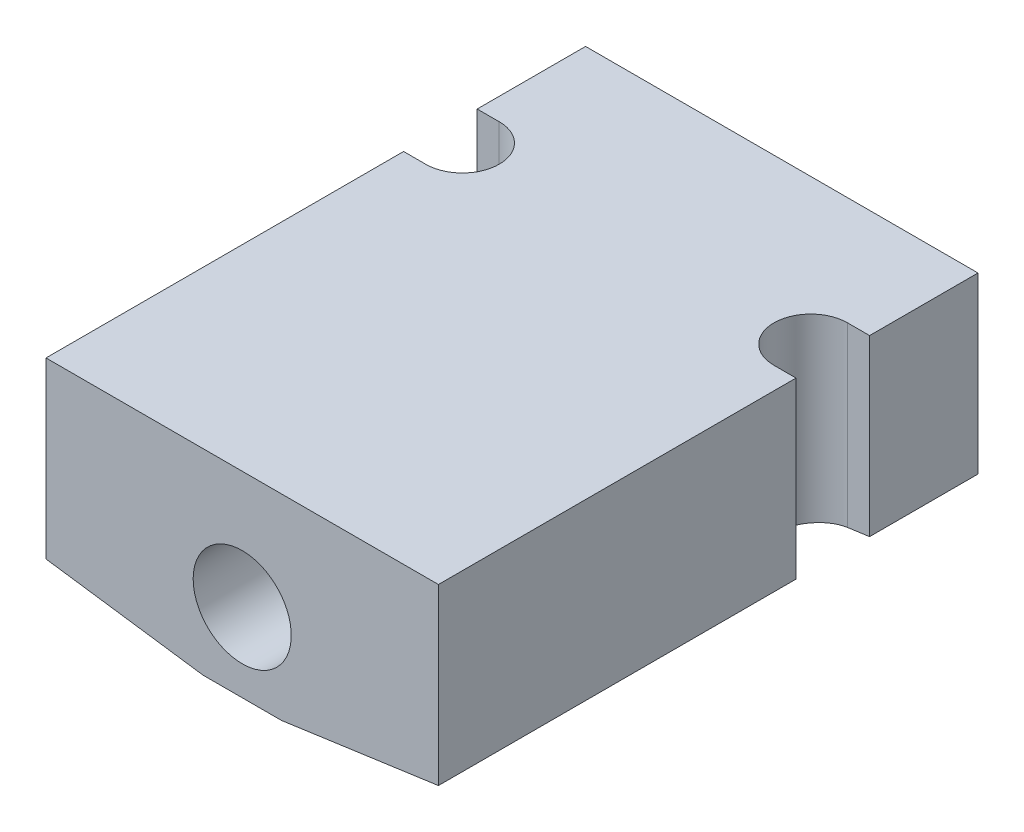
ISO-10303-21;
HEADER;
FILE_DESCRIPTION(('STEP AP214'),'2;1');
FILE_NAME('part.step','',(''),(''),'','','');
FILE_SCHEMA(('AUTOMOTIVE_DESIGN { 1 0 10303 214 1 1 1 1 }'));
ENDSEC;
DATA;
#1=APPLICATION_CONTEXT('core data for automotive mechanical design processes');
#2=APPLICATION_PROTOCOL_DEFINITION('international standard','automotive_design',2000,#1);
#3=PRODUCT_CONTEXT('',#1,'mechanical');
#4=PRODUCT('Part','Part','',(#3));
#5=PRODUCT_RELATED_PRODUCT_CATEGORY('part','',(#4));
#6=PRODUCT_DEFINITION_FORMATION('','',#4);
#7=PRODUCT_DEFINITION_CONTEXT('part definition',#1,'design');
#8=PRODUCT_DEFINITION('design','',#6,#7);
#9=PRODUCT_DEFINITION_SHAPE('','',#8);
#10=(LENGTH_UNIT() NAMED_UNIT(*) SI_UNIT(.MILLI.,.METRE.));
#11=(NAMED_UNIT(*) PLANE_ANGLE_UNIT() SI_UNIT($,.RADIAN.));
#12=(NAMED_UNIT(*) SI_UNIT($,.STERADIAN.) SOLID_ANGLE_UNIT());
#13=UNCERTAINTY_MEASURE_WITH_UNIT(LENGTH_MEASURE(1.E-05),#10,'distance_accuracy_value','');
#14=(GEOMETRIC_REPRESENTATION_CONTEXT(3) GLOBAL_UNCERTAINTY_ASSIGNED_CONTEXT((#13)) GLOBAL_UNIT_ASSIGNED_CONTEXT((#10,
#11,#12)) REPRESENTATION_CONTEXT('',''));
#15=CARTESIAN_POINT('',(0.,0.,0.));
#16=DIRECTION('',(0.,0.,1.));
#17=DIRECTION('',(1.,0.,0.));
#18=AXIS2_PLACEMENT_3D('',#15,#16,#17);
#19=CARTESIAN_POINT('',(12.7,-6.35,34.925));
#20=DIRECTION('',(-1.,0.,0.));
#21=DIRECTION('',(0.,-1.,0.));
#22=AXIS2_PLACEMENT_3D('',#19,#20,#21);
#23=PLANE('',#22);
#24=DIRECTION('',(0.,1.,0.));
#25=VECTOR('',#24,1.);
#26=CARTESIAN_POINT('',(12.7,-6.35,7.01675));
#27=LINE('',#26,#25);
#28=CARTESIAN_POINT('',(12.7,-4.92210511942369,7.01675));
#29=VERTEX_POINT('',#28);
#30=CARTESIAN_POINT('',(12.7,6.35,7.01675));
#31=VERTEX_POINT('',#30);
#32=EDGE_CURVE('E165',#29,#31,#27,.T.);
#33=ORIENTED_EDGE('',*,*,#32,.F.);
#34=DIRECTION('',(0.,0.,-1.));
#35=VECTOR('',#34,1.);
#36=CARTESIAN_POINT('',(12.7,-4.92210511942369,34.925));
#37=LINE('',#36,#35);
#38=CARTESIAN_POINT('',(12.7,-4.92210511942369,0.));
#39=VERTEX_POINT('',#38);
#40=EDGE_CURVE('E216',#29,#39,#37,.T.);
#41=ORIENTED_EDGE('',*,*,#40,.T.);
#42=DIRECTION('',(0.,1.,0.));
#43=VECTOR('',#42,1.);
#44=CARTESIAN_POINT('',(12.7,-6.35,0.));
#45=LINE('',#44,#43);
#46=CARTESIAN_POINT('',(12.7,6.35,0.));
#47=VERTEX_POINT('',#46);
#48=EDGE_CURVE('E206',#39,#47,#45,.T.);
#49=ORIENTED_EDGE('',*,*,#48,.T.);
#50=DIRECTION('',(0.,0.,-1.));
#51=VECTOR('',#50,1.);
#52=CARTESIAN_POINT('',(12.7,6.35,34.925));
#53=LINE('',#52,#51);
#54=EDGE_CURVE('E214',#31,#47,#53,.T.);
#55=ORIENTED_EDGE('',*,*,#54,.F.);
#56=EDGE_LOOP('',(#33,#41,#49,#55));
#57=FACE_BOUND('',#56,.T.);
#58=ADVANCED_FACE('F37',(#57),#23,.F.);
#59=DIRECTION('',(0.,1.,0.));
#60=VECTOR('',#59,1.);
#61=CARTESIAN_POINT('',(12.7,-6.35,11.77925));
#62=LINE('',#61,#60);
#63=CARTESIAN_POINT('',(12.7,-4.92210511942369,11.77925));
#64=VERTEX_POINT('',#63);
#65=CARTESIAN_POINT('',(12.7,6.35,11.77925));
#66=VERTEX_POINT('',#65);
#67=EDGE_CURVE('E52',#64,#66,#62,.T.);
#68=ORIENTED_EDGE('',*,*,#67,.T.);
#69=CARTESIAN_POINT('',(12.7,6.35,34.925));
#70=VERTEX_POINT('',#69);
#71=EDGE_CURVE('E159',#70,#66,#53,.T.);
#72=ORIENTED_EDGE('',*,*,#71,.F.);
#73=DIRECTION('',(0.,1.,0.));
#74=VECTOR('',#73,1.);
#75=CARTESIAN_POINT('',(12.7,-6.35,34.925));
#76=LINE('',#75,#74);
#77=CARTESIAN_POINT('',(12.7,-4.92210511942369,34.925));
#78=VERTEX_POINT('',#77);
#79=EDGE_CURVE('E196',#78,#70,#76,.T.);
#80=ORIENTED_EDGE('',*,*,#79,.F.);
#81=EDGE_CURVE('E217',#78,#64,#37,.T.);
#82=ORIENTED_EDGE('',*,*,#81,.T.);
#83=EDGE_LOOP('',(#68,#72,#80,#82));
#84=FACE_BOUND('',#83,.T.);
#85=ADVANCED_FACE('F292',(#84),#23,.F.);
#86=CARTESIAN_POINT('',(-12.7,6.35,34.925));
#87=DIRECTION('',(0.,-1.,0.));
#88=DIRECTION('',(0.,0.,-1.));
#89=AXIS2_PLACEMENT_3D('',#86,#87,#88);
#90=PLANE('',#89);
#91=DIRECTION('',(1.,0.,0.));
#92=VECTOR('',#91,1.);
#93=CARTESIAN_POINT('',(12.7,6.35,7.01675));
#94=LINE('',#93,#92);
#95=CARTESIAN_POINT('',(11.27125,6.35,7.01675));
#96=VERTEX_POINT('',#95);
#97=EDGE_CURVE('E144',#96,#31,#94,.T.);
#98=ORIENTED_EDGE('',*,*,#97,.T.);
#99=ORIENTED_EDGE('',*,*,#54,.T.);
#100=DIRECTION('',(-1.,0.,0.));
#101=VECTOR('',#100,1.);
#102=CARTESIAN_POINT('',(-12.7,6.35,0.));
#103=LINE('',#102,#101);
#104=CARTESIAN_POINT('',(-12.7,6.35,0.));
#105=VERTEX_POINT('',#104);
#106=EDGE_CURVE('E193',#47,#105,#103,.T.);
#107=ORIENTED_EDGE('',*,*,#106,.T.);
#108=DIRECTION('',(0.,0.,-1.));
#109=VECTOR('',#108,1.);
#110=CARTESIAN_POINT('',(-12.7,6.35,34.925));
#111=LINE('',#110,#109);
#112=CARTESIAN_POINT('',(-12.7,6.35,7.01675));
#113=VERTEX_POINT('',#112);
#114=EDGE_CURVE('E200',#113,#105,#111,.T.);
#115=ORIENTED_EDGE('',*,*,#114,.F.);
#116=DIRECTION('',(-1.,0.,0.));
#117=VECTOR('',#116,1.);
#118=CARTESIAN_POINT('',(-12.7,6.35,7.01675));
#119=LINE('',#118,#117);
#120=CARTESIAN_POINT('',(-11.27125,6.35,7.01675));
#121=VERTEX_POINT('',#120);
#122=EDGE_CURVE('E170',#121,#113,#119,.T.);
#123=ORIENTED_EDGE('',*,*,#122,.F.);
#124=CARTESIAN_POINT('',(-11.27125,6.35,9.398));
#125=DIRECTION('',(0.,1.,0.));
#126=DIRECTION('',(0.,0.,1.));
#127=AXIS2_PLACEMENT_3D('',#124,#125,#126);
#128=CIRCLE('',#127,2.38125);
#129=CARTESIAN_POINT('',(-11.27125,6.35,11.77925));
#130=VERTEX_POINT('',#129);
#131=EDGE_CURVE('E164',#130,#121,#128,.T.);
#132=ORIENTED_EDGE('',*,*,#131,.F.);
#133=DIRECTION('',(1.,0.,0.));
#134=VECTOR('',#133,1.);
#135=CARTESIAN_POINT('',(-11.27125,6.35,11.77925));
#136=LINE('',#135,#134);
#137=CARTESIAN_POINT('',(-12.7,6.35,11.77925));
#138=VERTEX_POINT('',#137);
#139=EDGE_CURVE('E172',#138,#130,#136,.T.);
#140=ORIENTED_EDGE('',*,*,#139,.F.);
#141=CARTESIAN_POINT('',(-12.7,6.35,34.925));
#142=VERTEX_POINT('',#141);
#143=EDGE_CURVE('E211',#142,#138,#111,.T.);
#144=ORIENTED_EDGE('',*,*,#143,.F.);
#145=DIRECTION('',(-1.,0.,0.));
#146=VECTOR('',#145,1.);
#147=CARTESIAN_POINT('',(-12.7,6.35,34.925));
#148=LINE('',#147,#146);
#149=EDGE_CURVE('E198',#70,#142,#148,.T.);
#150=ORIENTED_EDGE('',*,*,#149,.F.);
#151=ORIENTED_EDGE('',*,*,#71,.T.);
#152=DIRECTION('',(-1.,0.,0.));
#153=VECTOR('',#152,1.);
#154=CARTESIAN_POINT('',(11.27125,6.35,11.77925));
#155=LINE('',#154,#153);
#156=CARTESIAN_POINT('',(11.27125,6.35,11.77925));
#157=VERTEX_POINT('',#156);
#158=EDGE_CURVE('E140',#66,#157,#155,.T.);
#159=ORIENTED_EDGE('',*,*,#158,.T.);
#160=CARTESIAN_POINT('',(11.27125,6.35,9.398));
#161=DIRECTION('',(0.,-1.,0.));
#162=DIRECTION('',(0.,0.,1.));
#163=AXIS2_PLACEMENT_3D('',#160,#161,#162);
#164=CIRCLE('',#163,2.38125);
#165=EDGE_CURVE('E147',#157,#96,#164,.T.);
#166=ORIENTED_EDGE('',*,*,#165,.T.);
#167=EDGE_LOOP('',(#98,#99,#107,#115,#123,#132,#140,#144,#150,#151,#159,#166));
#168=FACE_BOUND('',#167,.T.);
#169=ADVANCED_FACE('F156',(#168),#90,.F.);
#170=CARTESIAN_POINT('',(12.7,-4.92210511942369,34.925));
#171=DIRECTION('',(-0.139173100960063,0.990268068741571,0.));
#172=DIRECTION('',(-0.990268068741571,-0.139173100960063,0.));
#173=AXIS2_PLACEMENT_3D('',#170,#171,#172);
#174=PLANE('',#173);
#175=ORIENTED_EDGE('',*,*,#40,.F.);
#176=DIRECTION('',(0.990268068741571,0.139173100960063,0.));
#177=VECTOR('',#176,1.);
#178=CARTESIAN_POINT('',(12.7,-4.92210511942369,7.01675));
#179=LINE('',#178,#177);
#180=CARTESIAN_POINT('',(11.27125,-5.12290283700473,7.01675));
#181=VERTEX_POINT('',#180);
#182=EDGE_CURVE('E11',#29,#181,#179,.F.);
#183=ORIENTED_EDGE('',*,*,#182,.T.);
#184=CARTESIAN_POINT('',(11.27125,-5.12290283700473,9.398));
#185=DIRECTION('',(-0.139173100960063,0.990268068741571,0.));
#186=DIRECTION('',(0.990268068741571,0.139173100960063,0.));
#187=AXIS2_PLACEMENT_3D('',#184,#185,#186);
#188=ELLIPSE('',#187,2.40465190705996,2.38125);
#189=CARTESIAN_POINT('',(11.27125,-5.12290283700473,11.77925));
#190=VERTEX_POINT('',#189);
#191=EDGE_CURVE('E45',#181,#190,#188,.T.);
#192=ORIENTED_EDGE('',*,*,#191,.T.);
#193=DIRECTION('',(-0.990268068741571,-0.139173100960063,0.));
#194=VECTOR('',#193,1.);
#195=CARTESIAN_POINT('',(12.7,-4.92210511942369,11.77925));
#196=LINE('',#195,#194);
#197=EDGE_CURVE('E141',#190,#64,#196,.F.);
#198=ORIENTED_EDGE('',*,*,#197,.T.);
#199=ORIENTED_EDGE('',*,*,#81,.F.);
#200=DIRECTION('',(-0.990268068741571,-0.139173100960063,0.));
#201=VECTOR('',#200,1.);
#202=CARTESIAN_POINT('',(12.7,-4.92210511942369,34.925));
#203=LINE('',#202,#201);
#204=CARTESIAN_POINT('',(2.5399999999998,-6.34999999999999,34.925));
#205=VERTEX_POINT('',#204);
#206=EDGE_CURVE('E231',#205,#78,#203,.F.);
#207=ORIENTED_EDGE('',*,*,#206,.F.);
#208=DIRECTION('',(0.,0.,1.));
#209=VECTOR('',#208,1.);
#210=CARTESIAN_POINT('',(2.53999999999974,-6.35,34.925));
#211=LINE('',#210,#209);
#212=CARTESIAN_POINT('',(2.53999999999974,-6.35,0.));
#213=VERTEX_POINT('',#212);
#214=EDGE_CURVE('E227',#213,#205,#211,.T.);
#215=ORIENTED_EDGE('',*,*,#214,.F.);
#216=DIRECTION('',(0.990268068741571,0.139173100960063,0.));
#217=VECTOR('',#216,1.);
#218=CARTESIAN_POINT('',(-10.6545169136121,-8.20436842053379,0.));
#219=LINE('',#218,#217);
#220=EDGE_CURVE('E222',#39,#213,#219,.F.);
#221=ORIENTED_EDGE('',*,*,#220,.F.);
#222=EDGE_LOOP('',(#175,#183,#192,#198,#199,#207,#215,#221));
#223=FACE_BOUND('',#222,.T.);
#224=ADVANCED_FACE('F245',(#223),#174,.F.);
#225=CARTESIAN_POINT('',(-12.7,-6.35,34.925));
#226=DIRECTION('',(1.,0.,0.));
#227=DIRECTION('',(0.,1.,0.));
#228=AXIS2_PLACEMENT_3D('',#225,#226,#227);
#229=PLANE('',#228);
#230=ORIENTED_EDGE('',*,*,#143,.T.);
#231=DIRECTION('',(0.,1.,0.));
#232=VECTOR('',#231,1.);
#233=CARTESIAN_POINT('',(-12.7,-6.35,11.77925));
#234=LINE('',#233,#232);
#235=CARTESIAN_POINT('',(-12.7,-4.92210511942369,11.77925));
#236=VERTEX_POINT('',#235);
#237=EDGE_CURVE('E179',#236,#138,#234,.T.);
#238=ORIENTED_EDGE('',*,*,#237,.F.);
#239=DIRECTION('',(0.,0.,1.));
#240=VECTOR('',#239,1.);
#241=CARTESIAN_POINT('',(-12.7,-4.92210511942369,34.925));
#242=LINE('',#241,#240);
#243=CARTESIAN_POINT('',(-12.7,-4.92210511942369,34.925));
#244=VERTEX_POINT('',#243);
#245=EDGE_CURVE('E233',#236,#244,#242,.T.);
#246=ORIENTED_EDGE('',*,*,#245,.T.);
#247=DIRECTION('',(0.,-1.,0.));
#248=VECTOR('',#247,1.);
#249=CARTESIAN_POINT('',(-12.7,-6.35,34.925));
#250=LINE('',#249,#248);
#251=EDGE_CURVE('E189',#142,#244,#250,.T.);
#252=ORIENTED_EDGE('',*,*,#251,.F.);
#253=EDGE_LOOP('',(#230,#238,#246,#252));
#254=FACE_BOUND('',#253,.T.);
#255=ADVANCED_FACE('F279',(#254),#229,.F.);
#256=CARTESIAN_POINT('',(-12.7,-4.92210511942369,0.));
#257=VERTEX_POINT('',#256);
#258=CARTESIAN_POINT('',(-12.7,-4.92210511942369,7.01675));
#259=VERTEX_POINT('',#258);
#260=EDGE_CURVE('E234',#257,#259,#242,.T.);
#261=ORIENTED_EDGE('',*,*,#260,.T.);
#262=DIRECTION('',(0.,1.,0.));
#263=VECTOR('',#262,1.);
#264=CARTESIAN_POINT('',(-12.7,-6.35,7.01675));
#265=LINE('',#264,#263);
#266=EDGE_CURVE('E60',#259,#113,#265,.T.);
#267=ORIENTED_EDGE('',*,*,#266,.T.);
#268=ORIENTED_EDGE('',*,*,#114,.T.);
#269=DIRECTION('',(0.,-1.,0.));
#270=VECTOR('',#269,1.);
#271=CARTESIAN_POINT('',(-12.7,-6.35,0.));
#272=LINE('',#271,#270);
#273=EDGE_CURVE('E188',#105,#257,#272,.T.);
#274=ORIENTED_EDGE('',*,*,#273,.T.);
#275=EDGE_LOOP('',(#261,#267,#268,#274));
#276=FACE_BOUND('',#275,.T.);
#277=ADVANCED_FACE('F262',(#276),#229,.F.);
#278=CARTESIAN_POINT('',(-12.7,-6.35,34.925));
#279=DIRECTION('',(0.,1.,0.));
#280=DIRECTION('',(0.,0.,1.));
#281=AXIS2_PLACEMENT_3D('',#278,#279,#280);
#282=PLANE('',#281);
#283=DIRECTION('',(1.,0.,0.));
#284=VECTOR('',#283,1.);
#285=CARTESIAN_POINT('',(-12.7,-6.35,0.));
#286=LINE('',#285,#284);
#287=CARTESIAN_POINT('',(-2.53999999999973,-6.35,0.));
#288=VERTEX_POINT('',#287);
#289=EDGE_CURVE('E203',#288,#213,#286,.T.);
#290=ORIENTED_EDGE('',*,*,#289,.T.);
#291=ORIENTED_EDGE('',*,*,#214,.T.);
#292=DIRECTION('',(1.,0.,0.));
#293=VECTOR('',#292,1.);
#294=CARTESIAN_POINT('',(-12.7,-6.35,34.925));
#295=LINE('',#294,#293);
#296=CARTESIAN_POINT('',(-2.53999999999984,-6.34999999999999,34.925));
#297=VERTEX_POINT('',#296);
#298=EDGE_CURVE('E192',#297,#205,#295,.T.);
#299=ORIENTED_EDGE('',*,*,#298,.F.);
#300=DIRECTION('',(0.,0.,-1.));
#301=VECTOR('',#300,1.);
#302=CARTESIAN_POINT('',(-2.53999999999975,-6.35,34.925));
#303=LINE('',#302,#301);
#304=EDGE_CURVE('E224',#297,#288,#303,.T.);
#305=ORIENTED_EDGE('',*,*,#304,.T.);
#306=EDGE_LOOP('',(#290,#291,#299,#305));
#307=FACE_BOUND('',#306,.T.);
#308=ADVANCED_FACE('F287',(#307),#282,.F.);
#309=CARTESIAN_POINT('',(-12.7,6.35,34.925));
#310=DIRECTION('',(0.,0.,-1.));
#311=DIRECTION('',(-1.,0.,0.));
#312=AXIS2_PLACEMENT_3D('',#309,#310,#311);
#313=PLANE('',#312);
#314=CARTESIAN_POINT('',(0.,-1.26999999999999,34.925));
#315=DIRECTION('',(0.,0.,-1.));
#316=DIRECTION('',(-1.,0.,0.));
#317=AXIS2_PLACEMENT_3D('',#314,#315,#316);
#318=CIRCLE('',#317,3.17499999999999);
#319=CARTESIAN_POINT('',(-3.17499999999999,-1.26999999999999,34.925));
#320=VERTEX_POINT('',#319);
#321=EDGE_CURVE('E185',#320,#320,#318,.T.);
#322=ORIENTED_EDGE('',*,*,#321,.T.);
#323=EDGE_LOOP('',(#322));
#324=FACE_BOUND('',#323,.T.);
#325=ORIENTED_EDGE('',*,*,#298,.T.);
#326=ORIENTED_EDGE('',*,*,#206,.T.);
#327=ORIENTED_EDGE('',*,*,#79,.T.);
#328=ORIENTED_EDGE('',*,*,#149,.T.);
#329=ORIENTED_EDGE('',*,*,#251,.T.);
#330=DIRECTION('',(-0.990268068741571,0.139173100960063,0.));
#331=VECTOR('',#330,1.);
#332=CARTESIAN_POINT('',(-2.53999999999975,-6.35,34.925));
#333=LINE('',#332,#331);
#334=EDGE_CURVE('E229',#244,#297,#333,.F.);
#335=ORIENTED_EDGE('',*,*,#334,.T.);
#336=EDGE_LOOP('',(#325,#326,#327,#328,#329,#335));
#337=FACE_BOUND('',#336,.T.);
#338=ADVANCED_FACE('F283',(#324,#337),#313,.F.);
#339=CARTESIAN_POINT('',(-12.7,6.35,0.));
#340=DIRECTION('',(0.,0.,-1.));
#341=DIRECTION('',(-1.,0.,0.));
#342=AXIS2_PLACEMENT_3D('',#339,#340,#341);
#343=PLANE('',#342);
#344=CARTESIAN_POINT('',(0.,-1.26999999999999,0.));
#345=DIRECTION('',(0.,0.,-1.));
#346=DIRECTION('',(-1.,0.,0.));
#347=AXIS2_PLACEMENT_3D('',#344,#345,#346);
#348=CIRCLE('',#347,3.17499999999999);
#349=CARTESIAN_POINT('',(-3.17499999999999,-1.26999999999999,0.));
#350=VERTEX_POINT('',#349);
#351=EDGE_CURVE('E178',#350,#350,#348,.T.);
#352=ORIENTED_EDGE('',*,*,#351,.F.);
#353=EDGE_LOOP('',(#352));
#354=FACE_BOUND('',#353,.T.);
#355=ORIENTED_EDGE('',*,*,#48,.F.);
#356=ORIENTED_EDGE('',*,*,#220,.T.);
#357=ORIENTED_EDGE('',*,*,#289,.F.);
#358=DIRECTION('',(0.990268068741571,-0.139173100960063,0.));
#359=VECTOR('',#358,1.);
#360=CARTESIAN_POINT('',(-14.2535066248046,-4.70377400165797,0.));
#361=LINE('',#360,#359);
#362=EDGE_CURVE('E220',#288,#257,#361,.F.);
#363=ORIENTED_EDGE('',*,*,#362,.T.);
#364=ORIENTED_EDGE('',*,*,#273,.F.);
#365=ORIENTED_EDGE('',*,*,#106,.F.);
#366=EDGE_LOOP('',(#355,#356,#357,#363,#364,#365));
#367=FACE_BOUND('',#366,.T.);
#368=ADVANCED_FACE('F257',(#354,#367),#343,.T.);
#369=CARTESIAN_POINT('',(-2.53999999999975,-6.35,34.925));
#370=DIRECTION('',(0.139173100960063,0.990268068741571,0.));
#371=DIRECTION('',(-0.990268068741571,0.139173100960063,0.));
#372=AXIS2_PLACEMENT_3D('',#369,#370,#371);
#373=PLANE('',#372);
#374=DIRECTION('',(0.990268068741571,-0.139173100960063,0.));
#375=VECTOR('',#374,1.);
#376=CARTESIAN_POINT('',(-2.53999999999972,-6.35,11.77925));
#377=LINE('',#376,#375);
#378=CARTESIAN_POINT('',(-11.27125,-5.12290283700473,11.77925));
#379=VERTEX_POINT('',#378);
#380=EDGE_CURVE('E241',#379,#236,#377,.F.);
#381=ORIENTED_EDGE('',*,*,#380,.F.);
#382=CARTESIAN_POINT('',(-11.27125,-5.12290283700473,9.398));
#383=DIRECTION('',(0.139173100960063,0.990268068741571,0.));
#384=DIRECTION('',(-0.990268068741571,0.139173100960063,0.));
#385=AXIS2_PLACEMENT_3D('',#382,#383,#384);
#386=ELLIPSE('',#385,2.40465190705996,2.38125);
#387=CARTESIAN_POINT('',(-11.27125,-5.12290283700473,7.01675));
#388=VERTEX_POINT('',#387);
#389=EDGE_CURVE('E239',#388,#379,#386,.F.);
#390=ORIENTED_EDGE('',*,*,#389,.F.);
#391=DIRECTION('',(-0.990268068741571,0.139173100960063,0.));
#392=VECTOR('',#391,1.);
#393=CARTESIAN_POINT('',(-2.53999999999976,-6.34999999999999,7.01675));
#394=LINE('',#393,#392);
#395=EDGE_CURVE('E237',#259,#388,#394,.F.);
#396=ORIENTED_EDGE('',*,*,#395,.F.);
#397=ORIENTED_EDGE('',*,*,#260,.F.);
#398=ORIENTED_EDGE('',*,*,#362,.F.);
#399=ORIENTED_EDGE('',*,*,#304,.F.);
#400=ORIENTED_EDGE('',*,*,#334,.F.);
#401=ORIENTED_EDGE('',*,*,#245,.F.);
#402=EDGE_LOOP('',(#381,#390,#396,#397,#398,#399,#400,#401));
#403=FACE_BOUND('',#402,.T.);
#404=ADVANCED_FACE('F39',(#403),#373,.F.);
#405=CARTESIAN_POINT('',(0.,-1.26999999999999,0.));
#406=DIRECTION('',(0.,0.,-1.));
#407=DIRECTION('',(-1.,0.,0.));
#408=AXIS2_PLACEMENT_3D('',#405,#406,#407);
#409=CYLINDRICAL_SURFACE('',#408,3.17499999999999);
#410=ORIENTED_EDGE('',*,*,#321,.F.);
#411=EDGE_LOOP('',(#410));
#412=FACE_BOUND('',#411,.T.);
#413=ORIENTED_EDGE('',*,*,#351,.T.);
#414=EDGE_LOOP('',(#413));
#415=FACE_BOUND('',#414,.T.);
#416=ADVANCED_FACE('F339',(#412,#415),#409,.F.);
#417=CARTESIAN_POINT('',(-11.27125,-6.35,9.398));
#418=DIRECTION('',(0.,1.,0.));
#419=DIRECTION('',(0.,0.,1.));
#420=AXIS2_PLACEMENT_3D('',#417,#418,#419);
#421=CYLINDRICAL_SURFACE('',#420,2.38125);
#422=ORIENTED_EDGE('',*,*,#389,.T.);
#423=DIRECTION('',(0.,1.,0.));
#424=VECTOR('',#423,1.);
#425=CARTESIAN_POINT('',(-11.27125,-6.35,11.77925));
#426=LINE('',#425,#424);
#427=EDGE_CURVE('E176',#379,#130,#426,.T.);
#428=ORIENTED_EDGE('',*,*,#427,.T.);
#429=ORIENTED_EDGE('',*,*,#131,.T.);
#430=DIRECTION('',(0.,1.,0.));
#431=VECTOR('',#430,1.);
#432=CARTESIAN_POINT('',(-11.27125,-6.35,7.01675));
#433=LINE('',#432,#431);
#434=EDGE_CURVE('E175',#388,#121,#433,.T.);
#435=ORIENTED_EDGE('',*,*,#434,.F.);
#436=EDGE_LOOP('',(#422,#428,#429,#435));
#437=FACE_BOUND('',#436,.T.);
#438=ADVANCED_FACE('F271',(#437),#421,.F.);
#439=CARTESIAN_POINT('',(-11.27125,-6.35,11.77925));
#440=DIRECTION('',(0.,0.,1.));
#441=DIRECTION('',(1.,0.,0.));
#442=AXIS2_PLACEMENT_3D('',#439,#440,#441);
#443=PLANE('',#442);
#444=ORIENTED_EDGE('',*,*,#380,.T.);
#445=ORIENTED_EDGE('',*,*,#237,.T.);
#446=ORIENTED_EDGE('',*,*,#139,.T.);
#447=ORIENTED_EDGE('',*,*,#427,.F.);
#448=EDGE_LOOP('',(#444,#445,#446,#447));
#449=FACE_BOUND('',#448,.T.);
#450=ADVANCED_FACE('F351',(#449),#443,.F.);
#451=CARTESIAN_POINT('',(-12.7,-6.35,7.01675));
#452=DIRECTION('',(0.,0.,-1.));
#453=DIRECTION('',(-1.,0.,0.));
#454=AXIS2_PLACEMENT_3D('',#451,#452,#453);
#455=PLANE('',#454);
#456=ORIENTED_EDGE('',*,*,#395,.T.);
#457=ORIENTED_EDGE('',*,*,#434,.T.);
#458=ORIENTED_EDGE('',*,*,#122,.T.);
#459=ORIENTED_EDGE('',*,*,#266,.F.);
#460=EDGE_LOOP('',(#456,#457,#458,#459));
#461=FACE_BOUND('',#460,.T.);
#462=ADVANCED_FACE('F269',(#461),#455,.F.);
#463=CARTESIAN_POINT('',(11.27125,-6.35,9.398));
#464=DIRECTION('',(0.,1.,0.));
#465=DIRECTION('',(0.,0.,1.));
#466=AXIS2_PLACEMENT_3D('',#463,#464,#465);
#467=CYLINDRICAL_SURFACE('',#466,2.38125);
#468=DIRECTION('',(0.,1.,0.));
#469=VECTOR('',#468,1.);
#470=CARTESIAN_POINT('',(11.27125,-6.35,7.01675));
#471=LINE('',#470,#469);
#472=EDGE_CURVE('E150',#181,#96,#471,.T.);
#473=ORIENTED_EDGE('',*,*,#472,.T.);
#474=ORIENTED_EDGE('',*,*,#165,.F.);
#475=DIRECTION('',(0.,1.,0.));
#476=VECTOR('',#475,1.);
#477=CARTESIAN_POINT('',(11.27125,-6.35,11.77925));
#478=LINE('',#477,#476);
#479=EDGE_CURVE('E136',#190,#157,#478,.T.);
#480=ORIENTED_EDGE('',*,*,#479,.F.);
#481=ORIENTED_EDGE('',*,*,#191,.F.);
#482=EDGE_LOOP('',(#473,#474,#480,#481));
#483=FACE_BOUND('',#482,.T.);
#484=ADVANCED_FACE('F148',(#483),#467,.F.);
#485=CARTESIAN_POINT('',(12.7,-6.35,7.01675));
#486=DIRECTION('',(0.,0.,1.));
#487=DIRECTION('',(1.,0.,0.));
#488=AXIS2_PLACEMENT_3D('',#485,#486,#487);
#489=PLANE('',#488);
#490=ORIENTED_EDGE('',*,*,#32,.T.);
#491=ORIENTED_EDGE('',*,*,#97,.F.);
#492=ORIENTED_EDGE('',*,*,#472,.F.);
#493=ORIENTED_EDGE('',*,*,#182,.F.);
#494=EDGE_LOOP('',(#490,#491,#492,#493));
#495=FACE_BOUND('',#494,.T.);
#496=ADVANCED_FACE('F248',(#495),#489,.T.);
#497=CARTESIAN_POINT('',(11.27125,-6.35,11.77925));
#498=DIRECTION('',(0.,0.,-1.));
#499=DIRECTION('',(-1.,0.,0.));
#500=AXIS2_PLACEMENT_3D('',#497,#498,#499);
#501=PLANE('',#500);
#502=ORIENTED_EDGE('',*,*,#479,.T.);
#503=ORIENTED_EDGE('',*,*,#158,.F.);
#504=ORIENTED_EDGE('',*,*,#67,.F.);
#505=ORIENTED_EDGE('',*,*,#197,.F.);
#506=EDGE_LOOP('',(#502,#503,#504,#505));
#507=FACE_BOUND('',#506,.T.);
#508=ADVANCED_FACE('F138',(#507),#501,.T.);
#509=CLOSED_SHELL('',(#58,#85,#169,#224,#255,#277,#308,#338,#368,#404,#416,#438,#450,#462,#484,
#496,#508));
#510=MANIFOLD_SOLID_BREP('B2',#509);
#511=ADVANCED_BREP_SHAPE_REPRESENTATION('',(#18,#510),#14);
#512=SHAPE_DEFINITION_REPRESENTATION(#9,#511);
ENDSEC;
END-ISO-10303-21;
